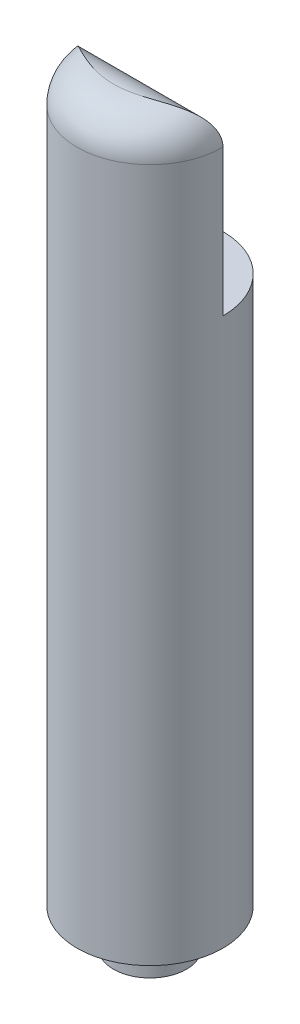
ISO-10303-21;
HEADER;
FILE_DESCRIPTION(('STEP AP214'),'2;1');
FILE_NAME('part.step','',(''),(''),'','','');
FILE_SCHEMA(('AUTOMOTIVE_DESIGN { 1 0 10303 214 1 1 1 1 }'));
ENDSEC;
DATA;
#1=APPLICATION_CONTEXT('core data for automotive mechanical design processes');
#2=APPLICATION_PROTOCOL_DEFINITION('international standard','automotive_design',2000,#1);
#3=PRODUCT_CONTEXT('',#1,'mechanical');
#4=PRODUCT('Part','Part','',(#3));
#5=PRODUCT_RELATED_PRODUCT_CATEGORY('part','',(#4));
#6=PRODUCT_DEFINITION_FORMATION('','',#4);
#7=PRODUCT_DEFINITION_CONTEXT('part definition',#1,'design');
#8=PRODUCT_DEFINITION('design','',#6,#7);
#9=PRODUCT_DEFINITION_SHAPE('','',#8);
#10=(LENGTH_UNIT() NAMED_UNIT(*) SI_UNIT(.MILLI.,.METRE.));
#11=(NAMED_UNIT(*) PLANE_ANGLE_UNIT() SI_UNIT($,.RADIAN.));
#12=(NAMED_UNIT(*) SI_UNIT($,.STERADIAN.) SOLID_ANGLE_UNIT());
#13=UNCERTAINTY_MEASURE_WITH_UNIT(LENGTH_MEASURE(1.E-05),#10,'distance_accuracy_value','');
#14=(GEOMETRIC_REPRESENTATION_CONTEXT(3) GLOBAL_UNCERTAINTY_ASSIGNED_CONTEXT((#13)) GLOBAL_UNIT_ASSIGNED_CONTEXT((#10,
#11,#12)) REPRESENTATION_CONTEXT('',''));
#15=CARTESIAN_POINT('',(0.,0.,0.));
#16=DIRECTION('',(0.,0.,1.));
#17=DIRECTION('',(1.,0.,0.));
#18=AXIS2_PLACEMENT_3D('',#15,#16,#17);
#19=CARTESIAN_POINT('',(0.,95.,5.));
#20=DIRECTION('',(1.,0.,0.));
#21=DIRECTION('',(0.,0.,-1.));
#22=AXIS2_PLACEMENT_3D('',#19,#20,#21);
#23=CYLINDRICAL_SURFACE('',#22,5.);
#24=DIRECTION('',(-1.,0.,0.));
#25=VECTOR('',#24,1.);
#26=CARTESIAN_POINT('',(10.,95.,0.));
#27=LINE('',#26,#25);
#28=CARTESIAN_POINT('',(4.00134261883828,95.,0.));
#29=VERTEX_POINT('',#28);
#30=CARTESIAN_POINT('',(10.,95.,0.));
#31=VERTEX_POINT('',#30);
#32=EDGE_CURVE('E70',#29,#31,#27,.F.);
#33=ORIENTED_EDGE('',*,*,#32,.F.);
#34=CARTESIAN_POINT('',(4.00134261883828,95.,0.));
#35=CARTESIAN_POINT('',(3.9192571845388,95.1095829535445,-5.83858758955765E-06));
#36=CARTESIAN_POINT('',(3.83268707317241,95.2157063488774,0.00360146017436887));
#37=CARTESIAN_POINT('',(3.65143368777091,95.420215841002,0.0166388719608626));
#38=CARTESIAN_POINT('',(3.55675892724819,95.5186098536572,0.0260629378787019));
#39=CARTESIAN_POINT('',(3.36023448688246,95.7068280018118,0.0493059806480449));
#40=CARTESIAN_POINT('',(3.25840408570384,95.7966737368977,0.0631134763719476));
#41=CARTESIAN_POINT('',(3.04808090020451,95.9675942466483,0.0937488894681588));
#42=CARTESIAN_POINT('',(2.93958638176028,96.0486667230656,0.110577595223049));
#43=CARTESIAN_POINT('',(2.60573882360792,96.2776101871982,0.16345033913635));
#44=CARTESIAN_POINT('',(2.37121782171549,96.4119742164138,0.201996883607484));
#45=CARTESIAN_POINT('',(2.00546856441407,96.5839686973408,0.257145889542302));
#46=CARTESIAN_POINT('',(1.8811170050831,96.6364056204063,0.275097310574173));
#47=CARTESIAN_POINT('',(1.62835222141872,96.7311299002371,0.308974454951973));
#48=CARTESIAN_POINT('',(1.49994093983002,96.7734220309253,0.324901129435451));
#49=CARTESIAN_POINT('',(1.23349334425648,96.8493273095916,0.354385838872365));
#50=CARTESIAN_POINT('',(1.095292046251,96.8824210662942,0.367791843906104));
#51=CARTESIAN_POINT('',(0.8162188744367,96.9367671678984,0.390249422428273));
#52=CARTESIAN_POINT('',(0.675346970266431,96.9580193780931,0.399300946380835));
#53=CARTESIAN_POINT('',(0.392192313227509,96.9884173244512,0.412356583449048));
#54=CARTESIAN_POINT('',(0.24991092154572,96.9975737745634,0.416365163256121));
#55=CARTESIAN_POINT('',(-0.0349586163572576,97.0036977208634,0.419038477346492));
#56=CARTESIAN_POINT('',(-0.177546739129846,97.0006661178544,0.417703606557386));
#57=CARTESIAN_POINT('',(-0.450521964056117,96.9831792037466,0.410111368887263));
#58=CARTESIAN_POINT('',(-0.580980683027787,96.9696480102895,0.404252385138154));
#59=CARTESIAN_POINT('',(-0.840183148192167,96.9324335278886,0.388480937347974));
#60=CARTESIAN_POINT('',(-0.968926966713717,96.9087506685155,0.378568644824621));
#61=CARTESIAN_POINT('',(-1.22396877060431,96.8514295110315,0.355307839030517));
#62=CARTESIAN_POINT('',(-1.35026475528011,96.81778340733,0.341956632653258));
#63=CARTESIAN_POINT('',(-1.59958118417476,96.7408186711508,0.312651388253051));
#64=CARTESIAN_POINT('',(-1.72260033156009,96.6974962710382,0.296696337031151));
#65=CARTESIAN_POINT('',(-2.09154867201583,96.5511279065187,0.245537361998741));
#66=CARTESIAN_POINT('',(-2.33131891351315,96.4330397210742,0.207669000781896));
#67=CARTESIAN_POINT('',(-2.7889233226409,96.160252357921,0.134441145301672));
#68=CARTESIAN_POINT('',(-3.0067892051408,96.0056072308492,0.0990780463061169));
#69=CARTESIAN_POINT('',(-3.35791603445116,95.7113596332869,0.0492984611285915));
#70=CARTESIAN_POINT('',(-3.49762695070718,95.579968592569,0.0317852598472485));
#71=CARTESIAN_POINT('',(-3.69555524769179,95.3710788038803,0.0132978025890632));
#72=CARTESIAN_POINT('',(-3.75963631791964,95.2994221985153,0.00843163601791898));
#73=CARTESIAN_POINT('',(-3.88366417488826,95.1524120778501,0.00178128955857572));
#74=CARTESIAN_POINT('',(-3.9436085419534,95.0770564422462,-1.10096845067738E-06));
#75=CARTESIAN_POINT('',(-4.00134261883828,95.,0.));
#76=B_SPLINE_CURVE_WITH_KNOTS('',3,(#34,#35,#36,#37,#38,#39,#40,#41,#42,#43,#44,#45,#46,#47,#48,
#49,#50,#51,#52,#53,#54,#55,#56,#57,#58,#59,#60,#61,#62,#63,#64,#65,#66,#67,#68,#69,#70,#71,#72,
#73,#74,#75),.UNSPECIFIED.,.F.,.F.,(4,2,2,2,2,2,2,2,2,2,2,2,2,2,2,2,2,2,2,2,4),(0.,
0.410471910831993,0.820517812449723,1.22949845723416,1.63858598076117,2.45344733356874,
2.86154452523256,3.26944929665043,3.69710485492519,4.12476527802506,4.55204664177156,
4.97929642628234,5.37269568820103,5.76607830496245,6.15976993194573,6.5536151176962,
7.3597901080433,8.16478051628188,8.74103771809149,9.02960910564069,9.3183478806622),.UNSPECIFIED.);
#77=CARTESIAN_POINT('',(-4.00134261883828,95.,0.));
#78=VERTEX_POINT('',#77);
#79=EDGE_CURVE('E11',#29,#78,#76,.T.);
#80=ORIENTED_EDGE('',*,*,#79,.T.);
#81=CARTESIAN_POINT('',(-10.,95.,0.));
#82=VERTEX_POINT('',#81);
#83=EDGE_CURVE('E57',#82,#78,#27,.F.);
#84=ORIENTED_EDGE('',*,*,#83,.F.);
#85=CARTESIAN_POINT('',(-10.,95.,0.));
#86=CARTESIAN_POINT('',(-10.0000186621462,95.109481128906,-2.67095448372106E-05));
#87=CARTESIAN_POINT('',(-9.99640510464395,95.2189487809777,0.00359468229512016));
#88=CARTESIAN_POINT('',(-9.98205407947085,95.436887226979,0.0179345321929953));
#89=CARTESIAN_POINT('',(-9.97132069824936,95.5453585565659,0.0286489191928138));
#90=CARTESIAN_POINT('',(-9.94296936316064,95.7597128234585,0.0568773691555696));
#91=CARTESIAN_POINT('',(-9.9253998926326,95.8656085286161,0.0743435411466067));
#92=CARTESIAN_POINT('',(-9.88362272288509,96.0748003444367,0.115722034743118));
#93=CARTESIAN_POINT('',(-9.85941439914113,96.178096209531,0.139634962798709));
#94=CARTESIAN_POINT('',(-9.80472959176057,96.3811629860674,0.193401065176742));
#95=CARTESIAN_POINT('',(-9.77426730480449,96.4809412916891,0.223240780610438));
#96=CARTESIAN_POINT('',(-9.707403231472,96.6766699717462,0.28837204733803));
#97=CARTESIAN_POINT('',(-9.67099881241379,96.7726186258839,0.323666014786202));
#98=CARTESIAN_POINT('',(-9.5533328841649,97.0542415608907,0.436999216654399));
#99=CARTESIAN_POINT('',(-9.46365532149096,97.2335590300103,0.522453277561387));
#100=CARTESIAN_POINT('',(-9.29879424318218,97.5153010191273,0.676836950648343));
#101=CARTESIAN_POINT('',(-9.22891680346262,97.6232678349325,0.741625025645634));
#102=CARTESIAN_POINT('',(-9.08164924199558,97.8304836258159,0.876454251929069));
#103=CARTESIAN_POINT('',(-9.00425709687325,97.9297302391538,0.946496816854011));
#104=CARTESIAN_POINT('',(-8.76185518300568,98.2144481017106,1.16279508776863));
#105=CARTESIAN_POINT('',(-8.5866781068222,98.3868001635109,1.31516605491869));
#106=CARTESIAN_POINT('',(-8.27203822653394,98.6501577584139,1.57950470468883));
#107=CARTESIAN_POINT('',(-8.13803760630387,98.7499210627327,1.68957734990039));
#108=CARTESIAN_POINT('',(-7.86104722004844,98.9344377621682,1.91115476753484));
#109=CARTESIAN_POINT('',(-7.71805401740357,99.0191853710499,2.0226600743532));
#110=CARTESIAN_POINT('',(-7.42409710519104,99.174886719524,2.24522141218175));
#111=CARTESIAN_POINT('',(-7.27312197218609,99.2458199696341,2.35627654017932));
#112=CARTESIAN_POINT('',(-6.96431462329925,99.3750429806096,2.57610843955653));
#113=CARTESIAN_POINT('',(-6.8064826711737,99.4333332272884,2.68488529833457));
#114=CARTESIAN_POINT('',(-6.4333751897412,99.5553855198772,2.93283423400923));
#115=CARTESIAN_POINT('',(-6.21582430709963,99.6149701922133,3.07064395790101));
#116=CARTESIAN_POINT('',(-5.77134687809699,99.7175177765771,3.3370492171827));
#117=CARTESIAN_POINT('',(-5.54441734026438,99.7604753391232,3.46564177628678));
#118=CARTESIAN_POINT('',(-5.08241188023016,99.8327165244243,3.71112074230516));
#119=CARTESIAN_POINT('',(-4.84734108268232,99.8620085869544,3.82801433933006));
#120=CARTESIAN_POINT('',(-4.36990210844634,99.9098326852446,4.04804635997963));
#121=CARTESIAN_POINT('',(-4.12753655342137,99.9283685392358,4.15118965464965));
#122=CARTESIAN_POINT('',(-3.63869429345518,99.9572960234078,4.34095196067851));
#123=CARTESIAN_POINT('',(-3.39228155020723,99.9677660337299,4.42772365063253));
#124=CARTESIAN_POINT('',(-2.89421757355262,99.9833068989249,4.5842745680929));
#125=CARTESIAN_POINT('',(-2.64257154616481,99.9883828802061,4.65406988096091));
#126=CARTESIAN_POINT('',(-2.07767772316836,99.996106694137,4.78899146958065));
#127=CARTESIAN_POINT('',(-1.76330130773517,99.9979519341869,4.84953927754232));
#128=CARTESIAN_POINT('',(-1.24917414857425,99.999499250028,4.92393586920952));
#129=CARTESIAN_POINT('',(-1.05068743231913,99.9997457724766,4.94678266441202));
#130=CARTESIAN_POINT('',(-0.72996052556808,99.9999435027498,4.97409886461233));
#131=CARTESIAN_POINT('',(-0.608031310894953,99.9999721984027,4.98225936203668));
#132=CARTESIAN_POINT('',(-0.413828993335563,99.9999942465566,4.99169777967294));
#133=CARTESIAN_POINT('',(-0.341624193407272,99.999997249708,4.99442549880829));
#134=CARTESIAN_POINT('',(-0.212942289660993,99.9999998037038,4.99789212412415));
#135=CARTESIAN_POINT('',(-0.15647337716182,99.999999965158,4.9989352311098));
#136=CARTESIAN_POINT('',(-0.0666676462309068,99.9999999808091,4.99983334427297));
#137=CARTESIAN_POINT('',(-0.0333337370939474,99.9999999338005,5.00000004848213));
#138=CARTESIAN_POINT('',(0.,100.,5.00000000000003));
#139=B_SPLINE_CURVE_WITH_KNOTS('',3,(#85,#86,#87,#88,#89,#90,#91,#92,#93,#94,#95,#96,#97,#98,
#99,#100,#101,#102,#103,#104,#105,#106,#107,#108,#109,#110,#111,#112,#113,#114,#115,#116,#117,
#118,#119,#120,#121,#122,#123,#124,#125,#126,#127,#128,#129,#130,#131,#132,#133,#134,#135,#136,
#137,#138),.UNSPECIFIED.,.F.,.F.,(4,2,2,2,2,2,2,2,2,2,2,2,2,2,2,2,2,2,2,2,2,2,2,2,2,2,4),(0.,
0.328302730117657,0.656417192510453,0.982245796518992,1.30810506211666,1.63323263819663,
1.95850465611579,2.60947408305884,3.04098213308044,3.47260669285976,4.33622925737949,
4.93572989894279,5.53546105549433,6.13607507084202,6.73666600322207,7.52867879459255,
8.32094619082361,9.1127236350197,9.90421984242299,10.6879240924535,11.4708828531573,
12.4298889508044,13.0289555962828,13.3954793452464,13.612232508259,13.7816597364275,
13.8816609864198),.UNSPECIFIED.);
#140=CARTESIAN_POINT('',(0.,100.,5.));
#141=VERTEX_POINT('',#140);
#142=EDGE_CURVE('E83',#141,#82,#139,.F.);
#143=ORIENTED_EDGE('',*,*,#142,.F.);
#144=CARTESIAN_POINT('',(0.,100.,5.00000000000003));
#145=CARTESIAN_POINT('',(0.0333342246904434,99.9999999919485,5.00000000062013));
#146=CARTESIAN_POINT('',(0.0666679318382451,100.000000009193,4.99983331950454));
#147=CARTESIAN_POINT('',(0.11194429202892,99.9999999627472,4.99938055749996));
#148=CARTESIAN_POINT('',(0.123888373596873,99.9999999438894,4.99923971709066));
#149=CARTESIAN_POINT('',(0.183608620272589,99.9999997989185,4.99842851985548));
#150=CARTESIAN_POINT('',(0.231380854224731,99.9999995207598,4.99743720782266));
#151=CARTESIAN_POINT('',(0.327822840911283,99.9999974234562,4.99474509388247));
#152=CARTESIAN_POINT('',(0.376492223332792,99.9999955748401,4.99303104100167));
#153=CARTESIAN_POINT('',(0.450934898986961,99.9999898487715,4.98986613856566));
#154=CARTESIAN_POINT('',(0.476719305099431,99.9999873330636,4.98867015770637));
#155=CARTESIAN_POINT('',(0.605628485689679,99.9999709676357,4.9821925199474));
#156=CARTESIAN_POINT('',(0.708680289859203,99.9999457589226,4.97541903753608));
#157=CARTESIAN_POINT('',(1.01784248879754,99.9997828571157,4.95032502497093));
#158=CARTESIAN_POINT('',(1.22358537445785,99.9995576640486,4.92723825641113));
#159=CARTESIAN_POINT('',(1.63342690119004,99.9983600344552,4.86869876846174));
#160=CARTESIAN_POINT('',(1.83752419911383,99.9973870398291,4.83323682401451));
#161=CARTESIAN_POINT('',(2.34405286043905,99.9930875369004,4.72987559488323));
#162=CARTESIAN_POINT('',(2.64500081144544,99.9888324467156,4.65461280939048));
#163=CARTESIAN_POINT('',(3.23969663258352,99.9736216406297,4.47964559384549));
#164=CARTESIAN_POINT('',(3.53343942059888,99.9626613290149,4.37992442829221));
#165=CARTESIAN_POINT('',(4.11257118853161,99.9299576254203,4.15853862402556));
#166=CARTESIAN_POINT('',(4.3979428378552,99.9081933343874,4.03683174788168));
#167=CARTESIAN_POINT('',(4.95831241644302,99.8493945392217,3.77468044275884));
#168=CARTESIAN_POINT('',(5.23331220221517,99.8123627821781,3.63423938771124));
#169=CARTESIAN_POINT('',(5.70277195713379,99.7303037813628,3.37592942545357));
#170=CARTESIAN_POINT('',(5.89988110128237,99.6897263547158,3.26144223521077));
#171=CARTESIAN_POINT('',(6.28681434994671,99.5954477346053,3.02566911424512));
#172=CARTESIAN_POINT('',(6.47663821465877,99.5417461095711,2.904382960049));
#173=CARTESIAN_POINT('',(6.84763717279321,99.4193105142843,2.657209181453));
#174=CARTESIAN_POINT('',(7.02883169395037,99.3506124651626,2.53133314136388));
#175=CARTESIAN_POINT('',(7.38184229370282,99.196104710065,2.27697873907008));
#176=CARTESIAN_POINT('',(7.55365964047622,99.1102973253128,2.14850073199631));
#177=CARTESIAN_POINT('',(7.95008958438294,98.8831364050198,1.84244258513636));
#178=CARTESIAN_POINT('',(8.16983186428416,98.7330812496108,1.66483209803055));
#179=CARTESIAN_POINT('',(8.58323482390857,98.3920074196377,1.31853681797523));
#180=CARTESIAN_POINT('',(8.77692328366495,98.2010329482229,1.14984263640582));
#181=CARTESIAN_POINT('',(9.09285473514287,97.8215872031395,0.866968422252701));
#182=CARTESIAN_POINT('',(9.22150334687803,97.641418327926,0.748868635196722));
#183=CARTESIAN_POINT('',(9.45380103481113,97.2551100622395,0.531956521522456));
#184=CARTESIAN_POINT('',(9.55747462820606,97.0489964461161,0.433125297884917));
#185=CARTESIAN_POINT('',(9.72154772342875,96.6469157285514,0.274861264411679));
#186=CARTESIAN_POINT('',(9.78612438703671,96.4541451985123,0.211727452652631));
#187=CARTESIAN_POINT('',(9.86474352404259,96.1559755637524,0.134375287583743));
#188=CARTESIAN_POINT('',(9.88790464516985,96.0551154874339,0.111486992878856));
#189=CARTESIAN_POINT('',(9.92790705749827,95.8509772906148,0.0718531712626069));
#190=CARTESIAN_POINT('',(9.94475070771367,95.7477000880317,0.0551053514818556));
#191=CARTESIAN_POINT('',(9.97214835117934,95.5374817981561,0.0278229570266679));
#192=CARTESIAN_POINT('',(9.98257742794377,95.4305083559682,0.0174118201305885));
#193=CARTESIAN_POINT('',(9.99651089353284,95.2156944435843,0.00348892643664454));
#194=CARTESIAN_POINT('',(10.0000170188917,95.1078541976313,-2.4560547630878E-05));
#195=CARTESIAN_POINT('',(10.,95.,0.));
#196=B_SPLINE_CURVE_WITH_KNOTS('',3,(#144,#145,#146,#147,#148,#149,#150,#151,#152,#153,#154,
#155,#156,#157,#158,#159,#160,#161,#162,#163,#164,#165,#166,#167,#168,#169,#170,#171,#172,#173,
#174,#175,#176,#177,#178,#179,#180,#181,#182,#183,#184,#185,#186,#187,#188,#189,#190,#191,#192,
#193,#194,#195),.UNSPECIFIED.,.F.,.F.,(4,2,2,2,2,2,2,2,2,2,2,2,2,2,2,2,2,2,2,2,2,2,2,2,2,4),(0.,
0.100001249992197,0.135835934097826,0.279178118292439,0.42527123528673,0.502707092721602,
0.812484968795602,1.43316188447759,2.05430247475667,2.98380240403824,3.9139401211723,
4.84588413513619,5.77766053669958,6.47173074753722,7.16582378496708,7.85827214717592,
8.55062662875167,9.50715874425213,10.462662727695,11.2125799031296,11.9617578806476,
12.59739247633,12.9150162436145,13.2325212882739,13.5560283356812,13.8794542251495),.UNSPECIFIED.);
#197=EDGE_CURVE('E122',#31,#141,#196,.F.);
#198=ORIENTED_EDGE('',*,*,#197,.F.);
#199=EDGE_LOOP('',(#33,#80,#84,#143,#198));
#200=FACE_BOUND('',#199,.T.);
#201=ADVANCED_FACE('F42',(#200),#23,.T.);
#202=CARTESIAN_POINT('',(0.,100.,0.));
#203=DIRECTION('',(0.,-1.,0.));
#204=DIRECTION('',(0.,0.,-1.));
#205=AXIS2_PLACEMENT_3D('',#202,#203,#204);
#206=CYLINDRICAL_SURFACE('',#205,10.);
#207=DIRECTION('',(0.,1.,0.));
#208=VECTOR('',#207,1.);
#209=CARTESIAN_POINT('',(10.,75.,0.));
#210=LINE('',#209,#208);
#211=CARTESIAN_POINT('',(10.,75.,0.));
#212=VERTEX_POINT('',#211);
#213=EDGE_CURVE('E89',#212,#31,#210,.T.);
#214=ORIENTED_EDGE('',*,*,#213,.T.);
#215=CARTESIAN_POINT('',(0.,95.,0.));
#216=DIRECTION('',(0.,1.,0.));
#217=DIRECTION('',(0.,0.,1.));
#218=AXIS2_PLACEMENT_3D('',#215,#216,#217);
#219=CIRCLE('',#218,10.);
#220=EDGE_CURVE('E111',#31,#82,#219,.F.);
#221=ORIENTED_EDGE('',*,*,#220,.T.);
#222=DIRECTION('',(0.,-1.,0.));
#223=VECTOR('',#222,1.);
#224=CARTESIAN_POINT('',(-10.,75.,0.));
#225=LINE('',#224,#223);
#226=CARTESIAN_POINT('',(-10.,75.,0.));
#227=VERTEX_POINT('',#226);
#228=EDGE_CURVE('E106',#82,#227,#225,.T.);
#229=ORIENTED_EDGE('',*,*,#228,.T.);
#230=CARTESIAN_POINT('',(0.,75.,0.));
#231=DIRECTION('',(0.,-1.,0.));
#232=DIRECTION('',(0.,0.,-1.));
#233=AXIS2_PLACEMENT_3D('',#230,#231,#232);
#234=CIRCLE('',#233,10.);
#235=EDGE_CURVE('E104',#227,#212,#234,.T.);
#236=ORIENTED_EDGE('',*,*,#235,.T.);
#237=EDGE_LOOP('',(#214,#221,#229,#236));
#238=FACE_BOUND('',#237,.T.);
#239=CARTESIAN_POINT('',(0.,0.,0.));
#240=DIRECTION('',(0.,1.,0.));
#241=DIRECTION('',(0.,0.,1.));
#242=AXIS2_PLACEMENT_3D('',#239,#240,#241);
#243=CIRCLE('',#242,10.);
#244=CARTESIAN_POINT('',(0.,0.,10.));
#245=VERTEX_POINT('',#244);
#246=EDGE_CURVE('E99',#245,#245,#243,.T.);
#247=ORIENTED_EDGE('',*,*,#246,.T.);
#248=EDGE_LOOP('',(#247));
#249=FACE_BOUND('',#248,.T.);
#250=ADVANCED_FACE('F108',(#238,#249),#206,.T.);
#251=CARTESIAN_POINT('',(0.,0.,0.));
#252=DIRECTION('',(0.,1.,0.));
#253=DIRECTION('',(0.,0.,1.));
#254=AXIS2_PLACEMENT_3D('',#251,#252,#253);
#255=PLANE('',#254);
#256=CARTESIAN_POINT('',(0.,0.,0.));
#257=DIRECTION('',(0.,1.,0.));
#258=DIRECTION('',(0.,0.,1.));
#259=AXIS2_PLACEMENT_3D('',#256,#257,#258);
#260=CIRCLE('',#259,5.);
#261=CARTESIAN_POINT('',(0.,0.,5.));
#262=VERTEX_POINT('',#261);
#263=EDGE_CURVE('E169',#262,#262,#260,.T.);
#264=ORIENTED_EDGE('',*,*,#263,.T.);
#265=EDGE_LOOP('',(#264));
#266=FACE_BOUND('',#265,.T.);
#267=ORIENTED_EDGE('',*,*,#246,.F.);
#268=EDGE_LOOP('',(#267));
#269=FACE_BOUND('',#268,.T.);
#270=ADVANCED_FACE('F140',(#266,#269),#255,.F.);
#271=CARTESIAN_POINT('',(10.,75.,-10.));
#272=DIRECTION('',(0.,-1.,0.));
#273=DIRECTION('',(0.,0.,-1.));
#274=AXIS2_PLACEMENT_3D('',#271,#272,#273);
#275=PLANE('',#274);
#276=ORIENTED_EDGE('',*,*,#235,.F.);
#277=DIRECTION('',(1.,0.,0.));
#278=VECTOR('',#277,1.);
#279=CARTESIAN_POINT('',(10.,75.,0.));
#280=LINE('',#279,#278);
#281=EDGE_CURVE('E93',#227,#212,#280,.T.);
#282=ORIENTED_EDGE('',*,*,#281,.T.);
#283=EDGE_LOOP('',(#276,#282));
#284=FACE_BOUND('',#283,.T.);
#285=ADVANCED_FACE('F103',(#284),#275,.F.);
#286=CARTESIAN_POINT('',(0.,0.,0.));
#287=DIRECTION('',(0.,0.,1.));
#288=DIRECTION('',(1.,0.,0.));
#289=AXIS2_PLACEMENT_3D('',#286,#287,#288);
#290=PLANE('',#289);
#291=CARTESIAN_POINT('',(0.,92.0017909934982,0.));
#292=DIRECTION('',(0.,0.,1.));
#293=DIRECTION('',(1.,0.,0.));
#294=AXIS2_PLACEMENT_3D('',#291,#292,#293);
#295=CIRCLE('',#294,5.);
#296=EDGE_CURVE('E63',#78,#29,#295,.T.);
#297=ORIENTED_EDGE('',*,*,#296,.T.);
#298=ORIENTED_EDGE('',*,*,#32,.T.);
#299=ORIENTED_EDGE('',*,*,#213,.F.);
#300=ORIENTED_EDGE('',*,*,#281,.F.);
#301=ORIENTED_EDGE('',*,*,#228,.F.);
#302=ORIENTED_EDGE('',*,*,#83,.T.);
#303=EDGE_LOOP('',(#297,#298,#299,#300,#301,#302));
#304=FACE_BOUND('',#303,.T.);
#305=ADVANCED_FACE('F91',(#304),#290,.F.);
#306=CARTESIAN_POINT('',(0.,95.,0.));
#307=DIRECTION('',(0.,1.,0.));
#308=DIRECTION('',(0.,0.,1.));
#309=AXIS2_PLACEMENT_3D('',#306,#307,#308);
#310=DEGENERATE_TOROIDAL_SURFACE('',#309,5.,5.,.T.);
#311=ORIENTED_EDGE('',*,*,#142,.T.);
#312=ORIENTED_EDGE('',*,*,#220,.F.);
#313=ORIENTED_EDGE('',*,*,#197,.T.);
#314=EDGE_LOOP('',(#311,#312,#313));
#315=FACE_BOUND('',#314,.T.);
#316=ADVANCED_FACE('F44',(#315),#310,.T.);
#317=CARTESIAN_POINT('',(0.,-5.,0.));
#318=DIRECTION('',(0.,1.,0.));
#319=DIRECTION('',(0.,0.,1.));
#320=AXIS2_PLACEMENT_3D('',#317,#318,#319);
#321=CYLINDRICAL_SURFACE('',#320,5.);
#322=CARTESIAN_POINT('',(0.,-5.,0.));
#323=DIRECTION('',(0.,1.,0.));
#324=DIRECTION('',(0.,0.,1.));
#325=AXIS2_PLACEMENT_3D('',#322,#323,#324);
#326=CIRCLE('',#325,5.);
#327=CARTESIAN_POINT('',(0.,-5.,5.));
#328=VERTEX_POINT('',#327);
#329=EDGE_CURVE('E128',#328,#328,#326,.T.);
#330=ORIENTED_EDGE('',*,*,#329,.T.);
#331=EDGE_LOOP('',(#330));
#332=FACE_BOUND('',#331,.T.);
#333=ORIENTED_EDGE('',*,*,#263,.F.);
#334=EDGE_LOOP('',(#333));
#335=FACE_BOUND('',#334,.T.);
#336=ADVANCED_FACE('F148',(#332,#335),#321,.T.);
#337=CARTESIAN_POINT('',(0.,-5.,0.));
#338=DIRECTION('',(0.,1.,0.));
#339=DIRECTION('',(0.,0.,1.));
#340=AXIS2_PLACEMENT_3D('',#337,#338,#339);
#341=PLANE('',#340);
#342=ORIENTED_EDGE('',*,*,#329,.F.);
#343=EDGE_LOOP('',(#342));
#344=FACE_BOUND('',#343,.T.);
#345=ADVANCED_FACE('F151',(#344),#341,.F.);
#346=CARTESIAN_POINT('',(0.,92.0017909934982,5.));
#347=DIRECTION('',(0.,0.,-1.));
#348=DIRECTION('',(-1.,0.,0.));
#349=AXIS2_PLACEMENT_3D('',#346,#347,#348);
#350=CYLINDRICAL_SURFACE('',#349,5.);
#351=CARTESIAN_POINT('',(0.,92.0017909934982,5.));
#352=DIRECTION('',(0.,0.,1.));
#353=DIRECTION('',(1.,0.,0.));
#354=AXIS2_PLACEMENT_3D('',#351,#352,#353);
#355=CIRCLE('',#354,5.);
#356=CARTESIAN_POINT('',(5.,92.0017909934982,5.));
#357=VERTEX_POINT('',#356);
#358=EDGE_CURVE('E167',#357,#357,#355,.T.);
#359=ORIENTED_EDGE('',*,*,#358,.T.);
#360=EDGE_LOOP('',(#359));
#361=FACE_BOUND('',#360,.T.);
#362=ORIENTED_EDGE('',*,*,#296,.F.);
#363=ORIENTED_EDGE('',*,*,#79,.F.);
#364=EDGE_LOOP('',(#362,#363));
#365=FACE_BOUND('',#364,.T.);
#366=ADVANCED_FACE('F154',(#361,#365),#350,.F.);
#367=CARTESIAN_POINT('',(0.,92.0017909934982,5.));
#368=DIRECTION('',(0.,0.,1.));
#369=DIRECTION('',(1.,0.,0.));
#370=AXIS2_PLACEMENT_3D('',#367,#368,#369);
#371=PLANE('',#370);
#372=ORIENTED_EDGE('',*,*,#358,.F.);
#373=EDGE_LOOP('',(#372));
#374=FACE_BOUND('',#373,.T.);
#375=ADVANCED_FACE('F159',(#374),#371,.F.);
#376=CLOSED_SHELL('',(#201,#250,#270,#285,#305,#316,#336,#345,#366,#375));
#377=MANIFOLD_SOLID_BREP('B2',#376);
#378=ADVANCED_BREP_SHAPE_REPRESENTATION('',(#18,#377),#14);
#379=SHAPE_DEFINITION_REPRESENTATION(#9,#378);
ENDSEC;
END-ISO-10303-21;
